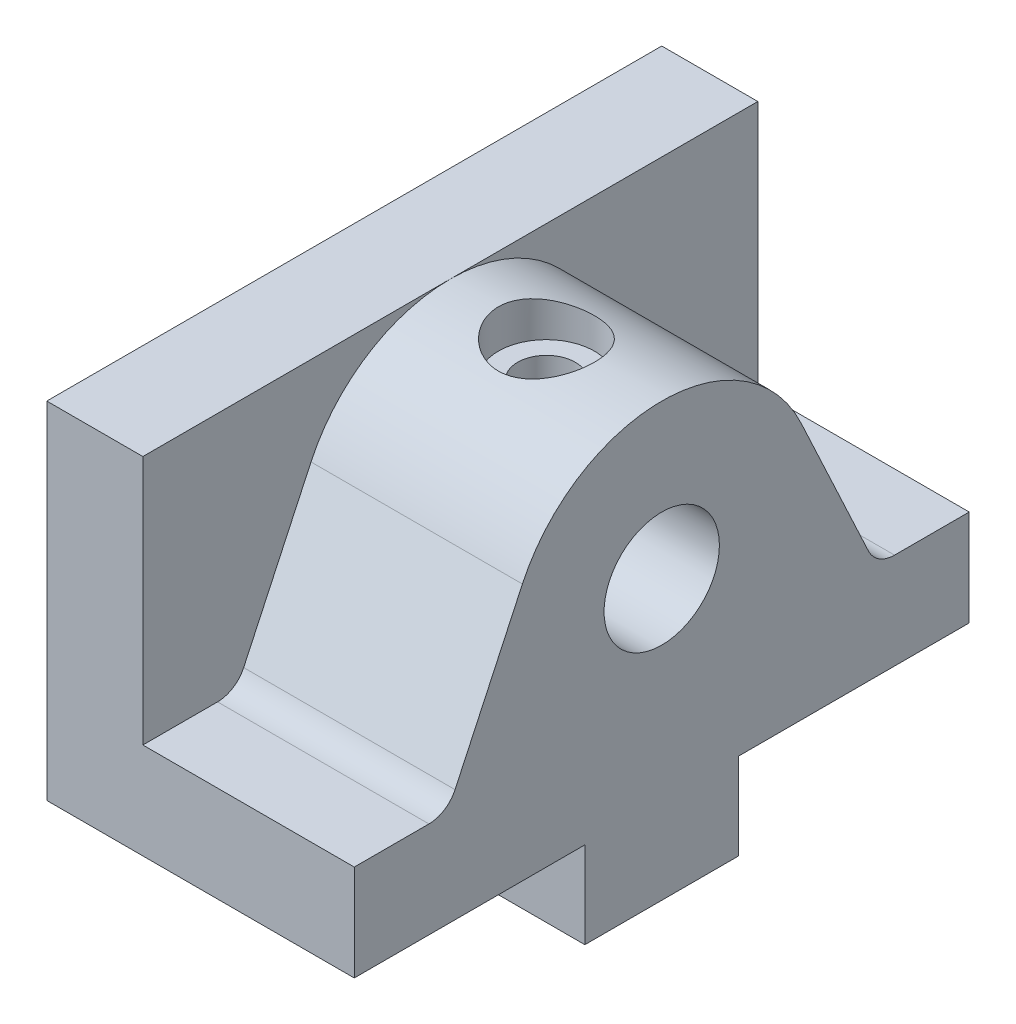
ISO-10303-21;
HEADER;
FILE_DESCRIPTION(('STEP AP214'),'2;1');
FILE_NAME('part.step','',(''),(''),'','','');
FILE_SCHEMA(('AUTOMOTIVE_DESIGN { 1 0 10303 214 1 1 1 1 }'));
ENDSEC;
DATA;
#1=APPLICATION_CONTEXT('core data for automotive mechanical design processes');
#2=APPLICATION_PROTOCOL_DEFINITION('international standard','automotive_design',2000,#1);
#3=PRODUCT_CONTEXT('',#1,'mechanical');
#4=PRODUCT('Part','Part','',(#3));
#5=PRODUCT_RELATED_PRODUCT_CATEGORY('part','',(#4));
#6=PRODUCT_DEFINITION_FORMATION('','',#4);
#7=PRODUCT_DEFINITION_CONTEXT('part definition',#1,'design');
#8=PRODUCT_DEFINITION('design','',#6,#7);
#9=PRODUCT_DEFINITION_SHAPE('','',#8);
#10=(LENGTH_UNIT() NAMED_UNIT(*) SI_UNIT(.MILLI.,.METRE.));
#11=(NAMED_UNIT(*) PLANE_ANGLE_UNIT() SI_UNIT($,.RADIAN.));
#12=(NAMED_UNIT(*) SI_UNIT($,.STERADIAN.) SOLID_ANGLE_UNIT());
#13=UNCERTAINTY_MEASURE_WITH_UNIT(LENGTH_MEASURE(1.E-05),#10,'distance_accuracy_value','');
#14=(GEOMETRIC_REPRESENTATION_CONTEXT(3) GLOBAL_UNCERTAINTY_ASSIGNED_CONTEXT((#13)) GLOBAL_UNIT_ASSIGNED_CONTEXT((#10,
#11,#12)) REPRESENTATION_CONTEXT('',''));
#15=CARTESIAN_POINT('',(0.,0.,0.));
#16=DIRECTION('',(0.,0.,1.));
#17=DIRECTION('',(1.,0.,0.));
#18=AXIS2_PLACEMENT_3D('',#15,#16,#17);
#19=CARTESIAN_POINT('',(0.,0.,32.));
#20=DIRECTION('',(0.,1.,0.));
#21=DIRECTION('',(0.,0.,1.));
#22=AXIS2_PLACEMENT_3D('',#19,#20,#21);
#23=PLANE('',#22);
#24=DIRECTION('',(1.,0.,0.));
#25=VECTOR('',#24,1.);
#26=CARTESIAN_POINT('',(0.,0.,-8.));
#27=LINE('',#26,#25);
#28=CARTESIAN_POINT('',(0.,0.,-8.));
#29=VERTEX_POINT('',#28);
#30=CARTESIAN_POINT('',(32.,0.,-8.));
#31=VERTEX_POINT('',#30);
#32=EDGE_CURVE('E190',#29,#31,#27,.T.);
#33=ORIENTED_EDGE('',*,*,#32,.F.);
#34=DIRECTION('',(0.,0.,-1.));
#35=VECTOR('',#34,1.);
#36=CARTESIAN_POINT('',(0.,0.,32.));
#37=LINE('',#36,#35);
#38=CARTESIAN_POINT('',(0.,0.,-32.));
#39=VERTEX_POINT('',#38);
#40=EDGE_CURVE('E295',#29,#39,#37,.T.);
#41=ORIENTED_EDGE('',*,*,#40,.T.);
#42=DIRECTION('',(1.,0.,0.));
#43=VECTOR('',#42,1.);
#44=CARTESIAN_POINT('',(0.,0.,-32.));
#45=LINE('',#44,#43);
#46=CARTESIAN_POINT('',(32.,0.,-32.));
#47=VERTEX_POINT('',#46);
#48=EDGE_CURVE('E269',#39,#47,#45,.T.);
#49=ORIENTED_EDGE('',*,*,#48,.T.);
#50=DIRECTION('',(0.,0.,-1.));
#51=VECTOR('',#50,1.);
#52=CARTESIAN_POINT('',(32.,0.,32.));
#53=LINE('',#52,#51);
#54=EDGE_CURVE('E291',#31,#47,#53,.T.);
#55=ORIENTED_EDGE('',*,*,#54,.F.);
#56=EDGE_LOOP('',(#33,#41,#49,#55));
#57=FACE_BOUND('',#56,.T.);
#58=ADVANCED_FACE('F33',(#57),#23,.F.);
#59=CARTESIAN_POINT('',(32.,10.,32.));
#60=DIRECTION('',(0.,-1.,0.));
#61=DIRECTION('',(1.,0.,0.));
#62=AXIS2_PLACEMENT_3D('',#59,#60,#61);
#63=PLANE('',#62);
#64=DIRECTION('',(1.,0.,0.));
#65=VECTOR('',#64,1.);
#66=CARTESIAN_POINT('',(-500000.,10.,24.2283340673724));
#67=LINE('',#66,#65);
#68=CARTESIAN_POINT('',(9.99999999987722,10.,24.2283340673724));
#69=VERTEX_POINT('',#68);
#70=CARTESIAN_POINT('',(32.,10.,24.2283340673724));
#71=VERTEX_POINT('',#70);
#72=EDGE_CURVE('E234',#69,#71,#67,.T.);
#73=ORIENTED_EDGE('',*,*,#72,.F.);
#74=DIRECTION('',(0.,0.,-1.));
#75=VECTOR('',#74,1.);
#76=CARTESIAN_POINT('',(10.,10.,32.));
#77=LINE('',#76,#75);
#78=CARTESIAN_POINT('',(10.,10.,32.));
#79=VERTEX_POINT('',#78);
#80=EDGE_CURVE('E284',#79,#69,#77,.T.);
#81=ORIENTED_EDGE('',*,*,#80,.F.);
#82=DIRECTION('',(-1.,0.,0.));
#83=VECTOR('',#82,1.);
#84=CARTESIAN_POINT('',(32.,10.,32.));
#85=LINE('',#84,#83);
#86=CARTESIAN_POINT('',(32.,10.,32.));
#87=VERTEX_POINT('',#86);
#88=EDGE_CURVE('E259',#87,#79,#85,.T.);
#89=ORIENTED_EDGE('',*,*,#88,.F.);
#90=DIRECTION('',(0.,0.,-1.));
#91=VECTOR('',#90,1.);
#92=CARTESIAN_POINT('',(32.,10.,32.));
#93=LINE('',#92,#91);
#94=EDGE_CURVE('E288',#87,#71,#93,.T.);
#95=ORIENTED_EDGE('',*,*,#94,.T.);
#96=EDGE_LOOP('',(#73,#81,#89,#95));
#97=FACE_BOUND('',#96,.T.);
#98=ADVANCED_FACE('F324',(#97),#63,.F.);
#99=CARTESIAN_POINT('',(10.,10.,32.));
#100=DIRECTION('',(-1.,0.,0.));
#101=DIRECTION('',(0.,-1.,0.));
#102=AXIS2_PLACEMENT_3D('',#99,#100,#101);
#103=PLANE('',#102);
#104=CARTESIAN_POINT('',(9.99999999999091,13.,-24.2283340673724));
#105=DIRECTION('',(-1.,0.,0.));
#106=DIRECTION('',(0.,-1.,0.));
#107=AXIS2_PLACEMENT_3D('',#104,#105,#106);
#108=CIRCLE('',#107,3.);
#109=CARTESIAN_POINT('',(9.99999999987722,11.7321452147779,-21.5094107062624));
#110=VERTEX_POINT('',#109);
#111=CARTESIAN_POINT('',(9.99999999987722,10.,-24.2283340673724));
#112=VERTEX_POINT('',#111);
#113=EDGE_CURVE('E244',#110,#112,#108,.F.);
#114=ORIENTED_EDGE('',*,*,#113,.T.);
#115=CARTESIAN_POINT('',(10.,10.,-32.));
#116=VERTEX_POINT('',#115);
#117=EDGE_CURVE('E283',#112,#116,#77,.T.);
#118=ORIENTED_EDGE('',*,*,#117,.T.);
#119=DIRECTION('',(0.,1.,0.));
#120=VECTOR('',#119,1.);
#121=CARTESIAN_POINT('',(10.,10.,-32.));
#122=LINE('',#121,#120);
#123=CARTESIAN_POINT('',(10.,36.,-32.));
#124=VERTEX_POINT('',#123);
#125=EDGE_CURVE('E253',#116,#124,#122,.T.);
#126=ORIENTED_EDGE('',*,*,#125,.T.);
#127=DIRECTION('',(0.,0.,-1.));
#128=VECTOR('',#127,1.);
#129=CARTESIAN_POINT('',(10.,36.,32.));
#130=LINE('',#129,#128);
#131=CARTESIAN_POINT('',(9.9999999999909,36.,0.));
#132=VERTEX_POINT('',#131);
#133=EDGE_CURVE('E263',#132,#124,#130,.T.);
#134=ORIENTED_EDGE('',*,*,#133,.F.);
#135=CARTESIAN_POINT('',(9.99999999999091,20.,0.));
#136=DIRECTION('',(-1.,0.,0.));
#137=DIRECTION('',(0.,-1.,0.));
#138=AXIS2_PLACEMENT_3D('',#135,#136,#137);
#139=CIRCLE('',#138,16.);
#140=CARTESIAN_POINT('',(9.99999999999091,26.7618921878512,-14.5009245925864));
#141=VERTEX_POINT('',#140);
#142=EDGE_CURVE('E213',#141,#132,#139,.F.);
#143=ORIENTED_EDGE('',*,*,#142,.F.);
#144=DIRECTION('',(0.,-0.906307787036649,-0.4226182617407));
#145=VECTOR('',#144,1.);
#146=CARTESIAN_POINT('',(9.99999999999091,26.7618921878786,-14.5009245925736));
#147=LINE('',#146,#145);
#148=EDGE_CURVE('E207',#141,#110,#147,.T.);
#149=ORIENTED_EDGE('',*,*,#148,.T.);
#150=EDGE_LOOP('',(#114,#118,#126,#134,#143,#149));
#151=FACE_BOUND('',#150,.T.);
#152=ADVANCED_FACE('F312',(#151),#103,.F.);
#153=CARTESIAN_POINT('',(9.99999999999091,13.,24.2283340673723));
#154=DIRECTION('',(-1.,0.,0.));
#155=DIRECTION('',(0.,-1.,0.));
#156=AXIS2_PLACEMENT_3D('',#153,#154,#155);
#157=CIRCLE('',#156,3.);
#158=CARTESIAN_POINT('',(9.99999999987722,11.7321452147779,21.5094107062624));
#159=VERTEX_POINT('',#158);
#160=EDGE_CURVE('E215',#69,#159,#157,.F.);
#161=ORIENTED_EDGE('',*,*,#160,.T.);
#162=DIRECTION('',(0.,-0.90630778703665,0.4226182617407));
#163=VECTOR('',#162,1.);
#164=CARTESIAN_POINT('',(9.99999999999091,26.7618921878786,14.5009245925736));
#165=LINE('',#164,#163);
#166=CARTESIAN_POINT('',(9.99999999987722,26.7618921878512,14.5009245925864));
#167=VERTEX_POINT('',#166);
#168=EDGE_CURVE('E210',#167,#159,#165,.T.);
#169=ORIENTED_EDGE('',*,*,#168,.F.);
#170=CARTESIAN_POINT('',(9.99999999999091,20.,0.));
#171=DIRECTION('',(-1.,0.,0.));
#172=DIRECTION('',(0.,-1.,0.));
#173=AXIS2_PLACEMENT_3D('',#170,#171,#172);
#174=CIRCLE('',#173,16.);
#175=EDGE_CURVE('E45',#167,#132,#174,.T.);
#176=ORIENTED_EDGE('',*,*,#175,.T.);
#177=CARTESIAN_POINT('',(10.,36.,32.));
#178=VERTEX_POINT('',#177);
#179=EDGE_CURVE('E280',#178,#132,#130,.T.);
#180=ORIENTED_EDGE('',*,*,#179,.F.);
#181=DIRECTION('',(0.,1.,0.));
#182=VECTOR('',#181,1.);
#183=CARTESIAN_POINT('',(10.,10.,32.));
#184=LINE('',#183,#182);
#185=EDGE_CURVE('E261',#79,#178,#184,.T.);
#186=ORIENTED_EDGE('',*,*,#185,.F.);
#187=ORIENTED_EDGE('',*,*,#80,.T.);
#188=EDGE_LOOP('',(#161,#169,#176,#180,#186,#187));
#189=FACE_BOUND('',#188,.T.);
#190=ADVANCED_FACE('F306',(#189),#103,.F.);
#191=CARTESIAN_POINT('',(10.,36.,32.));
#192=DIRECTION('',(0.,-1.,0.));
#193=DIRECTION('',(0.,0.,-1.));
#194=AXIS2_PLACEMENT_3D('',#191,#192,#193);
#195=PLANE('',#194);
#196=DIRECTION('',(-1.,0.,0.));
#197=VECTOR('',#196,1.);
#198=CARTESIAN_POINT('',(10.,36.,-32.));
#199=LINE('',#198,#197);
#200=CARTESIAN_POINT('',(0.,36.,-32.));
#201=VERTEX_POINT('',#200);
#202=EDGE_CURVE('E219',#124,#201,#199,.T.);
#203=ORIENTED_EDGE('',*,*,#202,.T.);
#204=DIRECTION('',(0.,0.,-1.));
#205=VECTOR('',#204,1.);
#206=CARTESIAN_POINT('',(0.,36.,32.));
#207=LINE('',#206,#205);
#208=CARTESIAN_POINT('',(0.,36.,32.));
#209=VERTEX_POINT('',#208);
#210=EDGE_CURVE('E299',#209,#201,#207,.T.);
#211=ORIENTED_EDGE('',*,*,#210,.F.);
#212=DIRECTION('',(-1.,0.,0.));
#213=VECTOR('',#212,1.);
#214=CARTESIAN_POINT('',(10.,36.,32.));
#215=LINE('',#214,#213);
#216=EDGE_CURVE('E249',#178,#209,#215,.T.);
#217=ORIENTED_EDGE('',*,*,#216,.F.);
#218=ORIENTED_EDGE('',*,*,#179,.T.);
#219=ORIENTED_EDGE('',*,*,#133,.T.);
#220=EDGE_LOOP('',(#203,#211,#217,#218,#219));
#221=FACE_BOUND('',#220,.T.);
#222=ADVANCED_FACE('F35',(#221),#195,.F.);
#223=CARTESIAN_POINT('',(0.,36.,32.));
#224=DIRECTION('',(1.,0.,0.));
#225=DIRECTION('',(0.,0.,-1.));
#226=AXIS2_PLACEMENT_3D('',#223,#224,#225);
#227=PLANE('',#226);
#228=DIRECTION('',(0.,-1.,0.));
#229=VECTOR('',#228,1.);
#230=CARTESIAN_POINT('',(0.,36.,-32.));
#231=LINE('',#230,#229);
#232=EDGE_CURVE('E266',#201,#39,#231,.T.);
#233=ORIENTED_EDGE('',*,*,#232,.T.);
#234=ORIENTED_EDGE('',*,*,#40,.F.);
#235=DIRECTION('',(0.,1.,0.));
#236=VECTOR('',#235,1.);
#237=CARTESIAN_POINT('',(0.,0.,-8.));
#238=LINE('',#237,#236);
#239=CARTESIAN_POINT('',(0.,-9.,-8.));
#240=VERTEX_POINT('',#239);
#241=EDGE_CURVE('E181',#240,#29,#238,.T.);
#242=ORIENTED_EDGE('',*,*,#241,.F.);
#243=DIRECTION('',(0.,0.,-1.));
#244=VECTOR('',#243,1.);
#245=CARTESIAN_POINT('',(0.,-9.,8.));
#246=LINE('',#245,#244);
#247=CARTESIAN_POINT('',(0.,-9.,8.));
#248=VERTEX_POINT('',#247);
#249=EDGE_CURVE('E187',#248,#240,#246,.T.);
#250=ORIENTED_EDGE('',*,*,#249,.F.);
#251=DIRECTION('',(0.,-1.,0.));
#252=VECTOR('',#251,1.);
#253=CARTESIAN_POINT('',(0.,-9.,8.));
#254=LINE('',#253,#252);
#255=CARTESIAN_POINT('',(0.,0.,8.));
#256=VERTEX_POINT('',#255);
#257=EDGE_CURVE('E183',#256,#248,#254,.T.);
#258=ORIENTED_EDGE('',*,*,#257,.F.);
#259=CARTESIAN_POINT('',(0.,0.,32.));
#260=VERTEX_POINT('',#259);
#261=EDGE_CURVE('E296',#260,#256,#37,.T.);
#262=ORIENTED_EDGE('',*,*,#261,.F.);
#263=DIRECTION('',(0.,-1.,0.));
#264=VECTOR('',#263,1.);
#265=CARTESIAN_POINT('',(0.,36.,32.));
#266=LINE('',#265,#264);
#267=EDGE_CURVE('E252',#209,#260,#266,.T.);
#268=ORIENTED_EDGE('',*,*,#267,.F.);
#269=ORIENTED_EDGE('',*,*,#210,.T.);
#270=EDGE_LOOP('',(#233,#234,#242,#250,#258,#262,#268,#269));
#271=FACE_BOUND('',#270,.T.);
#272=ADVANCED_FACE('F369',(#271),#227,.F.);
#273=ORIENTED_EDGE('',*,*,#261,.T.);
#274=DIRECTION('',(1.,0.,0.));
#275=VECTOR('',#274,1.);
#276=CARTESIAN_POINT('',(0.,0.,8.));
#277=LINE('',#276,#275);
#278=CARTESIAN_POINT('',(32.,0.,8.));
#279=VERTEX_POINT('',#278);
#280=EDGE_CURVE('E201',#256,#279,#277,.T.);
#281=ORIENTED_EDGE('',*,*,#280,.T.);
#282=CARTESIAN_POINT('',(32.,0.,32.));
#283=VERTEX_POINT('',#282);
#284=EDGE_CURVE('E292',#283,#279,#53,.T.);
#285=ORIENTED_EDGE('',*,*,#284,.F.);
#286=DIRECTION('',(1.,0.,0.));
#287=VECTOR('',#286,1.);
#288=CARTESIAN_POINT('',(0.,0.,32.));
#289=LINE('',#288,#287);
#290=EDGE_CURVE('E255',#260,#283,#289,.T.);
#291=ORIENTED_EDGE('',*,*,#290,.F.);
#292=EDGE_LOOP('',(#273,#281,#285,#291));
#293=FACE_BOUND('',#292,.T.);
#294=ADVANCED_FACE('F360',(#293),#23,.F.);
#295=CARTESIAN_POINT('',(32.,0.,32.));
#296=DIRECTION('',(-1.,0.,0.));
#297=DIRECTION('',(0.,0.,1.));
#298=AXIS2_PLACEMENT_3D('',#295,#296,#297);
#299=PLANE('',#298);
#300=CARTESIAN_POINT('',(32.,20.,0.));
#301=DIRECTION('',(1.,0.,0.));
#302=DIRECTION('',(0.,0.,-1.));
#303=AXIS2_PLACEMENT_3D('',#300,#301,#302);
#304=CIRCLE('',#303,6.);
#305=CARTESIAN_POINT('',(32.,20.,-6.));
#306=VERTEX_POINT('',#305);
#307=EDGE_CURVE('E198',#306,#306,#304,.T.);
#308=ORIENTED_EDGE('',*,*,#307,.F.);
#309=EDGE_LOOP('',(#308));
#310=FACE_BOUND('',#309,.T.);
#311=DIRECTION('',(0.,1.,0.));
#312=VECTOR('',#311,1.);
#313=CARTESIAN_POINT('',(32.,0.,-32.));
#314=LINE('',#313,#312);
#315=CARTESIAN_POINT('',(32.,10.,-32.));
#316=VERTEX_POINT('',#315);
#317=EDGE_CURVE('E272',#47,#316,#314,.T.);
#318=ORIENTED_EDGE('',*,*,#317,.T.);
#319=CARTESIAN_POINT('',(32.,10.,-24.2283340673724));
#320=VERTEX_POINT('',#319);
#321=EDGE_CURVE('E287',#320,#316,#93,.T.);
#322=ORIENTED_EDGE('',*,*,#321,.F.);
#323=CARTESIAN_POINT('',(32.,13.,-24.2283340673724));
#324=DIRECTION('',(1.,0.,0.));
#325=DIRECTION('',(0.,0.,-1.));
#326=AXIS2_PLACEMENT_3D('',#323,#324,#325);
#327=CIRCLE('',#326,3.);
#328=CARTESIAN_POINT('',(32.,11.7321452147779,-21.5094107062624));
#329=VERTEX_POINT('',#328);
#330=EDGE_CURVE('E224',#329,#320,#327,.T.);
#331=ORIENTED_EDGE('',*,*,#330,.F.);
#332=DIRECTION('',(0.,-0.906307787036649,-0.4226182617407));
#333=VECTOR('',#332,1.);
#334=CARTESIAN_POINT('',(32.,26.7618921878512,-14.5009245925864));
#335=LINE('',#334,#333);
#336=CARTESIAN_POINT('',(32.,26.7618921878512,-14.5009245925864));
#337=VERTEX_POINT('',#336);
#338=EDGE_CURVE('E221',#337,#329,#335,.T.);
#339=ORIENTED_EDGE('',*,*,#338,.F.);
#340=CARTESIAN_POINT('',(32.,20.,0.));
#341=DIRECTION('',(1.,0.,0.));
#342=DIRECTION('',(0.,0.,-1.));
#343=AXIS2_PLACEMENT_3D('',#340,#341,#342);
#344=CIRCLE('',#343,16.);
#345=CARTESIAN_POINT('',(32.,26.7618921878512,14.5009245925864));
#346=VERTEX_POINT('',#345);
#347=EDGE_CURVE('E216',#337,#346,#344,.T.);
#348=ORIENTED_EDGE('',*,*,#347,.T.);
#349=DIRECTION('',(0.,-0.906307787036649,0.4226182617407));
#350=VECTOR('',#349,1.);
#351=CARTESIAN_POINT('',(32.,26.7618921878512,14.5009245925864));
#352=LINE('',#351,#350);
#353=CARTESIAN_POINT('',(32.,11.7321452147779,21.5094107062624));
#354=VERTEX_POINT('',#353);
#355=EDGE_CURVE('E220',#346,#354,#352,.T.);
#356=ORIENTED_EDGE('',*,*,#355,.T.);
#357=CARTESIAN_POINT('',(32.,13.,24.2283340673723));
#358=DIRECTION('',(1.,0.,0.));
#359=DIRECTION('',(0.,0.,-1.));
#360=AXIS2_PLACEMENT_3D('',#357,#358,#359);
#361=CIRCLE('',#360,3.);
#362=EDGE_CURVE('E226',#71,#354,#361,.T.);
#363=ORIENTED_EDGE('',*,*,#362,.F.);
#364=ORIENTED_EDGE('',*,*,#94,.F.);
#365=DIRECTION('',(0.,1.,0.));
#366=VECTOR('',#365,1.);
#367=CARTESIAN_POINT('',(32.,0.,32.));
#368=LINE('',#367,#366);
#369=EDGE_CURVE('E257',#283,#87,#368,.T.);
#370=ORIENTED_EDGE('',*,*,#369,.F.);
#371=ORIENTED_EDGE('',*,*,#284,.T.);
#372=DIRECTION('',(0.,-1.,0.));
#373=VECTOR('',#372,1.);
#374=CARTESIAN_POINT('',(32.,-9.,8.));
#375=LINE('',#374,#373);
#376=CARTESIAN_POINT('',(32.,-9.,8.));
#377=VERTEX_POINT('',#376);
#378=EDGE_CURVE('E52',#279,#377,#375,.T.);
#379=ORIENTED_EDGE('',*,*,#378,.T.);
#380=DIRECTION('',(0.,0.,-1.));
#381=VECTOR('',#380,1.);
#382=CARTESIAN_POINT('',(32.,-9.,8.));
#383=LINE('',#382,#381);
#384=CARTESIAN_POINT('',(32.,-9.,-8.));
#385=VERTEX_POINT('',#384);
#386=EDGE_CURVE('E184',#377,#385,#383,.T.);
#387=ORIENTED_EDGE('',*,*,#386,.T.);
#388=DIRECTION('',(0.,1.,0.));
#389=VECTOR('',#388,1.);
#390=CARTESIAN_POINT('',(32.,0.,-8.));
#391=LINE('',#390,#389);
#392=EDGE_CURVE('E180',#385,#31,#391,.T.);
#393=ORIENTED_EDGE('',*,*,#392,.T.);
#394=ORIENTED_EDGE('',*,*,#54,.T.);
#395=EDGE_LOOP('',(#318,#322,#331,#339,#348,#356,#363,#364,#370,#371,#379,#387,#393,#394));
#396=FACE_BOUND('',#395,.T.);
#397=ADVANCED_FACE('F331',(#310,#396),#299,.F.);
#398=ORIENTED_EDGE('',*,*,#117,.F.);
#399=DIRECTION('',(1.,0.,0.));
#400=VECTOR('',#399,1.);
#401=CARTESIAN_POINT('',(-500000.,10.,-24.2283340673724));
#402=LINE('',#401,#400);
#403=EDGE_CURVE('E236',#112,#320,#402,.T.);
#404=ORIENTED_EDGE('',*,*,#403,.T.);
#405=ORIENTED_EDGE('',*,*,#321,.T.);
#406=DIRECTION('',(-1.,0.,0.));
#407=VECTOR('',#406,1.);
#408=CARTESIAN_POINT('',(32.,10.,-32.));
#409=LINE('',#408,#407);
#410=EDGE_CURVE('E275',#316,#116,#409,.T.);
#411=ORIENTED_EDGE('',*,*,#410,.T.);
#412=EDGE_LOOP('',(#398,#404,#405,#411));
#413=FACE_BOUND('',#412,.T.);
#414=ADVANCED_FACE('F365',(#413),#63,.F.);
#415=CARTESIAN_POINT('',(0.,0.,32.));
#416=DIRECTION('',(0.,0.,1.));
#417=DIRECTION('',(1.,0.,0.));
#418=AXIS2_PLACEMENT_3D('',#415,#416,#417);
#419=PLANE('',#418);
#420=ORIENTED_EDGE('',*,*,#216,.T.);
#421=ORIENTED_EDGE('',*,*,#267,.T.);
#422=ORIENTED_EDGE('',*,*,#290,.T.);
#423=ORIENTED_EDGE('',*,*,#369,.T.);
#424=ORIENTED_EDGE('',*,*,#88,.T.);
#425=ORIENTED_EDGE('',*,*,#185,.T.);
#426=EDGE_LOOP('',(#420,#421,#422,#423,#424,#425));
#427=FACE_BOUND('',#426,.T.);
#428=ADVANCED_FACE('F318',(#427),#419,.T.);
#429=CARTESIAN_POINT('',(0.,0.,-32.));
#430=DIRECTION('',(0.,0.,1.));
#431=DIRECTION('',(1.,0.,0.));
#432=AXIS2_PLACEMENT_3D('',#429,#430,#431);
#433=PLANE('',#432);
#434=ORIENTED_EDGE('',*,*,#202,.F.);
#435=ORIENTED_EDGE('',*,*,#125,.F.);
#436=ORIENTED_EDGE('',*,*,#410,.F.);
#437=ORIENTED_EDGE('',*,*,#317,.F.);
#438=ORIENTED_EDGE('',*,*,#48,.F.);
#439=ORIENTED_EDGE('',*,*,#232,.F.);
#440=EDGE_LOOP('',(#434,#435,#436,#437,#438,#439));
#441=FACE_BOUND('',#440,.T.);
#442=ADVANCED_FACE('F341',(#441),#433,.F.);
#443=CARTESIAN_POINT('',(-500000.,26.7618921878512,-14.5009245925864));
#444=DIRECTION('',(0.,-0.4226182617407,0.906307787036649));
#445=DIRECTION('',(0.,-0.906307787036649,-0.4226182617407));
#446=AXIS2_PLACEMENT_3D('',#443,#444,#445);
#447=PLANE('',#446);
#448=ORIENTED_EDGE('',*,*,#148,.F.);
#449=DIRECTION('',(1.,0.,0.));
#450=VECTOR('',#449,1.);
#451=CARTESIAN_POINT('',(-500000.,26.7618921878512,-14.5009245925864));
#452=LINE('',#451,#450);
#453=EDGE_CURVE('E60',#141,#337,#452,.T.);
#454=ORIENTED_EDGE('',*,*,#453,.T.);
#455=ORIENTED_EDGE('',*,*,#338,.T.);
#456=DIRECTION('',(1.,0.,0.));
#457=VECTOR('',#456,1.);
#458=CARTESIAN_POINT('',(-500000.,11.7321452147779,-21.5094107062624));
#459=LINE('',#458,#457);
#460=EDGE_CURVE('E239',#110,#329,#459,.T.);
#461=ORIENTED_EDGE('',*,*,#460,.F.);
#462=EDGE_LOOP('',(#448,#454,#455,#461));
#463=FACE_BOUND('',#462,.T.);
#464=ADVANCED_FACE('F349',(#463),#447,.F.);
#465=CARTESIAN_POINT('',(-500000.,13.,-24.2283340673724));
#466=DIRECTION('',(1.,0.,0.));
#467=DIRECTION('',(0.,0.,-1.));
#468=AXIS2_PLACEMENT_3D('',#465,#466,#467);
#469=CYLINDRICAL_SURFACE('',#468,3.);
#470=ORIENTED_EDGE('',*,*,#113,.F.);
#471=ORIENTED_EDGE('',*,*,#460,.T.);
#472=ORIENTED_EDGE('',*,*,#330,.T.);
#473=ORIENTED_EDGE('',*,*,#403,.F.);
#474=EDGE_LOOP('',(#470,#471,#472,#473));
#475=FACE_BOUND('',#474,.T.);
#476=ADVANCED_FACE('F399',(#475),#469,.F.);
#477=CARTESIAN_POINT('',(-500000.,13.,24.2283340673723));
#478=DIRECTION('',(1.,0.,0.));
#479=DIRECTION('',(0.,0.,-1.));
#480=AXIS2_PLACEMENT_3D('',#477,#478,#479);
#481=CYLINDRICAL_SURFACE('',#480,3.);
#482=ORIENTED_EDGE('',*,*,#160,.F.);
#483=ORIENTED_EDGE('',*,*,#72,.T.);
#484=ORIENTED_EDGE('',*,*,#362,.T.);
#485=DIRECTION('',(1.,0.,0.));
#486=VECTOR('',#485,1.);
#487=CARTESIAN_POINT('',(-500000.,11.7321452147779,21.5094107062624));
#488=LINE('',#487,#486);
#489=EDGE_CURVE('E232',#159,#354,#488,.T.);
#490=ORIENTED_EDGE('',*,*,#489,.F.);
#491=EDGE_LOOP('',(#482,#483,#484,#490));
#492=FACE_BOUND('',#491,.T.);
#493=ADVANCED_FACE('F328',(#492),#481,.F.);
#494=CARTESIAN_POINT('',(-500000.,26.7618921878512,14.5009245925864));
#495=DIRECTION('',(0.,0.4226182617407,0.90630778703665));
#496=DIRECTION('',(0.,-0.90630778703665,0.4226182617407));
#497=AXIS2_PLACEMENT_3D('',#494,#495,#496);
#498=PLANE('',#497);
#499=DIRECTION('',(1.,0.,0.));
#500=VECTOR('',#499,1.);
#501=CARTESIAN_POINT('',(-500000.,26.7618921878512,14.5009245925864));
#502=LINE('',#501,#500);
#503=EDGE_CURVE('E212',#167,#346,#502,.T.);
#504=ORIENTED_EDGE('',*,*,#503,.F.);
#505=ORIENTED_EDGE('',*,*,#168,.T.);
#506=ORIENTED_EDGE('',*,*,#489,.T.);
#507=ORIENTED_EDGE('',*,*,#355,.F.);
#508=EDGE_LOOP('',(#504,#505,#506,#507));
#509=FACE_BOUND('',#508,.T.);
#510=ADVANCED_FACE('F336',(#509),#498,.T.);
#511=CARTESIAN_POINT('',(-500000.,20.,0.));
#512=DIRECTION('',(1.,0.,0.));
#513=DIRECTION('',(0.,0.,-1.));
#514=AXIS2_PLACEMENT_3D('',#511,#512,#513);
#515=CYLINDRICAL_SURFACE('',#514,16.);
#516=CARTESIAN_POINT('',(20.,35.1986841535707,4.99999999999999));
#517=CARTESIAN_POINT('',(20.2733881444511,35.1986858388479,4.99999815120852));
#518=CARTESIAN_POINT('',(20.5467950748157,35.2061412603009,4.97750155166163));
#519=CARTESIAN_POINT('',(21.0855766435056,35.2350255598557,4.88836701605166));
#520=CARTESIAN_POINT('',(21.3509490909254,35.2564582140987,4.82171715130071));
#521=CARTESIAN_POINT('',(21.865779607726,35.3106375534646,4.646791528944));
#522=CARTESIAN_POINT('',(22.1152649324196,35.3433642077793,4.53858942946874));
#523=CARTESIAN_POINT('',(22.5926107834518,35.4164162487397,4.28387656692855));
#524=CARTESIAN_POINT('',(22.8204674798361,35.4567429774309,4.13735903622813));
#525=CARTESIAN_POINT('',(23.2559154699691,35.5420051067458,3.80478428249333));
#526=CARTESIAN_POINT('',(23.4626544377388,35.5870449353906,3.61763759888651));
#527=CARTESIAN_POINT('',(23.8423840528312,35.6757698344115,3.21144818582855));
#528=CARTESIAN_POINT('',(24.0153699877737,35.7194547149035,2.99240101008173));
#529=CARTESIAN_POINT('',(24.3264442520397,35.8017421356018,2.52250364998253));
#530=CARTESIAN_POINT('',(24.4636548153208,35.8402073825098,2.27104622609014));
#531=CARTESIAN_POINT('',(24.693504199418,35.9065020733195,1.74721693142469));
#532=CARTESIAN_POINT('',(24.7861534965947,35.9343340167957,1.47484999395991));
#533=CARTESIAN_POINT('',(24.921404512386,35.9754870328338,0.925857427876588));
#534=CARTESIAN_POINT('',(24.9654629991498,35.9892295593652,0.649622861884884));
#535=CARTESIAN_POINT('',(25.0068973857499,36.0021438350406,0.0933632559496174));
#536=CARTESIAN_POINT('',(25.0042838974357,36.001318896403,-0.186660907881112));
#537=CARTESIAN_POINT('',(24.9534068336578,35.9854846453017,-0.732297921408681));
#538=CARTESIAN_POINT('',(24.90672246595,35.9709660388861,-0.998074537246561));
#539=CARTESIAN_POINT('',(24.7716200398306,35.9299793024358,-1.51781225338293));
#540=CARTESIAN_POINT('',(24.6831992596564,35.9035103930892,-1.77177258191746));
#541=CARTESIAN_POINT('',(24.466119243704,35.8409383891792,-2.26431241261267));
#542=CARTESIAN_POINT('',(24.3369807657523,35.8047213446677,-2.50266562248492));
#543=CARTESIAN_POINT('',(24.0425156011842,35.7264689181548,-2.95481004460392));
#544=CARTESIAN_POINT('',(23.8771797634481,35.6844320658271,-3.16859502483331));
#545=CARTESIAN_POINT('',(23.506905460803,35.5969468293421,-3.57495079380936));
#546=CARTESIAN_POINT('',(23.3006037246558,35.5514292793946,-3.76626619636399));
#547=CARTESIAN_POINT('',(22.8584195926905,35.463624617787,-4.11195897038724));
#548=CARTESIAN_POINT('',(22.6225337176437,35.4213378870288,-4.26633199104441));
#549=CARTESIAN_POINT('',(22.1243301246158,35.3444338653166,-4.53521860076047));
#550=CARTESIAN_POINT('',(21.861746364043,35.3099076117647,-4.64926722798775));
#551=CARTESIAN_POINT('',(21.3197620326404,35.2535018111547,-4.8311338378195));
#552=CARTESIAN_POINT('',(21.0403675432316,35.2316177207011,-4.89896843059808));
#553=CARTESIAN_POINT('',(20.4847201897019,35.203982536282,-4.98405940745515));
#554=CARTESIAN_POINT('',(20.2087920150705,35.1976186557504,-5.0032381741554));
#555=CARTESIAN_POINT('',(19.6576410340315,35.2000430983967,-4.99586977992563));
#556=CARTESIAN_POINT('',(19.3824181252138,35.2088290802922,-4.96932968445779));
#557=CARTESIAN_POINT('',(18.848766813403,35.2399582993557,-4.87299494053064));
#558=CARTESIAN_POINT('',(18.5900829037156,35.2619021640793,-4.80447324642567));
#559=CARTESIAN_POINT('',(18.0879128320285,35.3164514932538,-4.6276149464455));
#560=CARTESIAN_POINT('',(17.844429156327,35.3490586964908,-4.51927184685156));
#561=CARTESIAN_POINT('',(17.3718435609232,35.4224215861276,-4.26230042624158));
#562=CARTESIAN_POINT('',(17.1433543376385,35.4633841395884,-4.11260589954904));
#563=CARTESIAN_POINT('',(16.7140386145605,35.5484139589106,-3.77842563472626));
#564=CARTESIAN_POINT('',(16.513219324306,35.5924820294262,-3.59393085877026));
#565=CARTESIAN_POINT('',(16.1363585363545,35.680967502506,-3.18629179102149));
#566=CARTESIAN_POINT('',(15.9616888554456,35.7253236914259,-2.96186259916099));
#567=CARTESIAN_POINT('',(15.6524358267186,35.8075623937461,-2.485806182612));
#568=CARTESIAN_POINT('',(15.5178506427588,35.845445203637,-2.23418020444057));
#569=CARTESIAN_POINT('',(15.2938777501153,35.9102524771399,-1.71242209333302));
#570=CARTESIAN_POINT('',(15.204162848627,35.9372559824475,-1.4424407371407));
#571=CARTESIAN_POINT('',(15.0717098456422,35.9776097059428,-0.890229016231134));
#572=CARTESIAN_POINT('',(15.0289570436667,35.990964196571,-0.608002513366912));
#573=CARTESIAN_POINT('',(14.9928359930016,36.0022321361783,-0.0519397466014212));
#574=CARTESIAN_POINT('',(14.9974861993167,36.0007651762952,0.221756767779827));
#575=CARTESIAN_POINT('',(15.0512472441938,35.9840391232427,0.764292887686064));
#576=CARTESIAN_POINT('',(15.1003551839665,35.9687809293069,1.03313280871111));
#577=CARTESIAN_POINT('',(15.2403760368863,35.9263828337909,1.55502047391504));
#578=CARTESIAN_POINT('',(15.3307584313776,35.899393918403,1.80822367378908));
#579=CARTESIAN_POINT('',(15.55028330883,35.8363178235255,2.29599370199196));
#580=CARTESIAN_POINT('',(15.6794324398909,35.8002290836789,2.53055732509068));
#581=CARTESIAN_POINT('',(15.9778910333684,35.7211958753129,2.98304677986773));
#582=CARTESIAN_POINT('',(16.1484140898387,35.6780603899497,3.20013842819623));
#583=CARTESIAN_POINT('',(16.5226395577751,35.5903494619749,3.60328316559622));
#584=CARTESIAN_POINT('',(16.7263518965851,35.5457735917335,3.78932693403593));
#585=CARTESIAN_POINT('',(17.1692628793198,35.458475702749,4.13131463641768));
#586=CARTESIAN_POINT('',(17.4094136123193,35.4158640332135,4.28605711968009));
#587=CARTESIAN_POINT('',(17.9135924809401,35.3392050100631,4.55281882983713));
#588=CARTESIAN_POINT('',(18.1776109057774,35.3051541945195,4.66485533611833));
#589=CARTESIAN_POINT('',(18.6988904692666,35.2522624175559,4.83484721744872));
#590=CARTESIAN_POINT('',(18.9548101897492,35.2323726005928,4.89659759350127));
#591=CARTESIAN_POINT('',(19.4738153283123,35.2055842579894,4.97916983261866));
#592=CARTESIAN_POINT('',(19.7368989647805,35.1986825317074,5.00000177922473));
#593=CARTESIAN_POINT('',(20.,35.1986841535707,4.99999999999999));
#594=B_SPLINE_CURVE_WITH_KNOTS('',3,(#516,#517,#518,#519,#520,#521,#522,#523,#524,#525,#526,
#527,#528,#529,#530,#531,#532,#533,#534,#535,#536,#537,#538,#539,#540,#541,#542,#543,#544,#545,
#546,#547,#548,#549,#550,#551,#552,#553,#554,#555,#556,#557,#558,#559,#560,#561,#562,#563,#564,
#565,#566,#567,#568,#569,#570,#571,#572,#573,#574,#575,#576,#577,#578,#579,#580,#581,#582,#583,
#584,#585,#586,#587,#588,#589,#590,#591,#592,#593),.UNSPECIFIED.,.T.,.F.,(4,2,2,2,2,2,2,2,2,2,2,
2,2,2,2,2,2,2,2,2,2,2,2,2,2,2,2,2,2,2,2,2,2,2,2,2,2,2,4),(0.,0.8191925501926,1.63860650823621,
2.4565745764701,3.27468721969408,4.11828322202559,4.96199691763474,5.8247928785379,
6.68738589670421,7.52334891340956,8.35912185886008,9.16603931878084,9.97300940759627,
10.78985618433,11.6069097085222,12.4580135574876,13.3092175941449,14.1699388374148,
15.0303505581974,15.8561973316032,16.6819164888478,17.4837588818589,18.2857320902129,
19.1107045324704,19.9358915205627,20.7952775125497,21.6546241327745,22.5076095717314,
23.3603279257153,24.1775520976717,24.9947229877817,25.8016738606782,26.6087631965522,
27.443227724294,28.2779423109722,29.1403118201674,30.0023320322718,30.7908941750078,
31.5792619677388),.UNSPECIFIED.);
#595=CARTESIAN_POINT('',(20.,35.1986841535707,4.99999999999999));
#596=VERTEX_POINT('',#595);
#597=EDGE_CURVE('E11',#596,#596,#594,.T.);
#598=ORIENTED_EDGE('',*,*,#597,.F.);
#599=EDGE_LOOP('',(#598));
#600=FACE_BOUND('',#599,.T.);
#601=ORIENTED_EDGE('',*,*,#453,.F.);
#602=ORIENTED_EDGE('',*,*,#142,.T.);
#603=ORIENTED_EDGE('',*,*,#175,.F.);
#604=ORIENTED_EDGE('',*,*,#503,.T.);
#605=ORIENTED_EDGE('',*,*,#347,.F.);
#606=EDGE_LOOP('',(#601,#602,#603,#604,#605));
#607=FACE_BOUND('',#606,.T.);
#608=ADVANCED_FACE('F337',(#600,#607),#515,.T.);
#609=CARTESIAN_POINT('',(8.,20.,0.));
#610=DIRECTION('',(1.,0.,0.));
#611=DIRECTION('',(0.,0.,-1.));
#612=AXIS2_PLACEMENT_3D('',#609,#610,#611);
#613=CYLINDRICAL_SURFACE('',#612,6.);
#614=CARTESIAN_POINT('',(20.,25.1961524227066,3.));
#615=CARTESIAN_POINT('',(20.0782002332591,25.1961533815141,2.99999910875737));
#616=CARTESIAN_POINT('',(20.1564099984646,25.1979258119113,2.99693611207794));
#617=CARTESIAN_POINT('',(20.3122080751421,25.2049393165712,2.98473565374508));
#618=CARTESIAN_POINT('',(20.3897960802685,25.2101820056608,2.97559536411628));
#619=CARTESIAN_POINT('',(20.6209440142464,25.2308820055821,2.9391691225804));
#620=CARTESIAN_POINT('',(20.7727509105333,25.2513107660721,2.902878058149));
#621=CARTESIAN_POINT('',(21.0663916335235,25.3024774692754,2.80829998089522));
#622=CARTESIAN_POINT('',(21.2082738017509,25.3331605157792,2.75012989346617));
#623=CARTESIAN_POINT('',(21.4802627617008,25.4012807296697,2.61380253964662));
#624=CARTESIAN_POINT('',(21.6103689158749,25.4387182624135,2.53564419197537));
#625=CARTESIAN_POINT('',(21.8669201461477,25.5199058355984,2.35399963256536));
#626=CARTESIAN_POINT('',(21.9921782021559,25.5639218457163,2.24895611137363));
#627=CARTESIAN_POINT('',(22.2242243696895,25.651159547025,2.01976141989962));
#628=CARTESIAN_POINT('',(22.3310032682567,25.6943808324562,1.89560077655245));
#629=CARTESIAN_POINT('',(22.5301016877323,25.7786442898889,1.62146869109162));
#630=CARTESIAN_POINT('',(22.6209613659272,25.8193431875225,1.47032156718994));
#631=CARTESIAN_POINT('',(22.7754224974281,25.8905226880054,1.15247107964639));
#632=CARTESIAN_POINT('',(22.8390411532466,25.9210097369081,0.985777614653088));
#633=CARTESIAN_POINT('',(22.9325139979892,25.9664138360306,0.654134831556282));
#634=CARTESIAN_POINT('',(22.9644485796481,25.9822844059557,0.489905370480165));
#635=CARTESIAN_POINT('',(23.000498355444,26.0002275160526,0.15771188707923));
#636=CARTESIAN_POINT('',(23.0046303821323,26.0023084049244,-0.0102498138110381));
#637=CARTESIAN_POINT('',(22.9857599673652,25.9928894562274,-0.329497576667921));
#638=CARTESIAN_POINT('',(22.9650859119219,25.9825548724797,-0.48096360970459));
#639=CARTESIAN_POINT('',(22.9013575098035,25.9512273620779,-0.777941303579841));
#640=CARTESIAN_POINT('',(22.8583014884221,25.9302336378681,-0.92345251797663));
#641=CARTESIAN_POINT('',(22.7507521442304,25.8791474825337,-1.20692822064062));
#642=CARTESIAN_POINT('',(22.6859704687994,25.8489331854518,-1.34476044303001));
#643=CARTESIAN_POINT('',(22.537210343292,25.7821294400464,-1.60793023199368));
#644=CARTESIAN_POINT('',(22.4532250204903,25.7455377104437,-1.73326330217191));
#645=CARTESIAN_POINT('',(22.2593115260605,25.665331584921,-1.98052168794677));
#646=CARTESIAN_POINT('',(22.1476814893583,25.6213803174282,-2.10100497271934));
#647=CARTESIAN_POINT('',(21.9062402580911,25.5336311808584,-2.32231036115798));
#648=CARTESIAN_POINT('',(21.7764152061043,25.4898334550261,-2.42311733790258));
#649=CARTESIAN_POINT('',(21.4920178566593,25.4043208466552,-2.6085269546345));
#650=CARTESIAN_POINT('',(21.336397564354,25.3629148575067,-2.691694028528));
#651=CARTESIAN_POINT('',(21.0924369453882,25.3091519440867,-2.79542837524198));
#652=CARTESIAN_POINT('',(21.0093436895952,25.2926194649543,-2.82650797342001));
#653=CARTESIAN_POINT('',(20.8401913969656,25.2629847346327,-2.88131297532033));
#654=CARTESIAN_POINT('',(20.7541342255252,25.2498803689785,-2.90504291399185));
#655=CARTESIAN_POINT('',(20.586628379776,25.2285545598839,-2.94323927983803));
#656=CARTESIAN_POINT('',(20.5053505743622,25.2200298226321,-2.95828810706486));
#657=CARTESIAN_POINT('',(20.3415647613341,25.2067273715729,-2.98163903200842));
#658=CARTESIAN_POINT('',(20.2590574162517,25.2019477092041,-2.98994463830254));
#659=CARTESIAN_POINT('',(20.0935289931973,25.1963366286361,-2.99968663811345));
#660=CARTESIAN_POINT('',(20.0105081180563,25.1955037402621,-3.00112558946313));
#661=CARTESIAN_POINT('',(19.8447135392353,25.1978095319997,-2.99712742537402));
#662=CARTESIAN_POINT('',(19.7619398192495,25.2009479440325,-2.99169077406596));
#663=CARTESIAN_POINT('',(19.5331408639573,25.2150449301025,-2.96710135231213));
#664=CARTESIAN_POINT('',(19.3880891897367,25.230191606605,-2.9405616310018));
#665=CARTESIAN_POINT('',(19.1048690892031,25.270816663845,-2.86709067362229));
#666=CARTESIAN_POINT('',(18.9667029081698,25.2962983902876,-2.82015283383763));
#667=CARTESIAN_POINT('',(18.6937738960801,25.3560878027303,-2.70494224478442));
#668=CARTESIAN_POINT('',(18.5594650720959,25.3907496041273,-2.63578205088436));
#669=CARTESIAN_POINT('',(18.303590061634,25.4646832779242,-2.47886133231338));
#670=CARTESIAN_POINT('',(18.1820304691885,25.5039575138799,-2.3910912526382));
#671=CARTESIAN_POINT('',(17.9390643733681,25.588640051403,-2.18651145695799));
#672=CARTESIAN_POINT('',(17.8196087291,25.6341975208474,-2.067435804994));
#673=CARTESIAN_POINT('',(17.6017631047052,25.7220270231092,-1.81021349814979));
#674=CARTESIAN_POINT('',(17.5033802403245,25.7642979430822,-1.67206042712514));
#675=CARTESIAN_POINT('',(17.3282788724264,25.8422408580664,-1.37560608443379));
#676=CARTESIAN_POINT('',(17.2522006581169,25.8777092522688,-1.21686929217555));
#677=CARTESIAN_POINT('',(17.1285862756894,25.9365006466729,-0.88656709446955));
#678=CARTESIAN_POINT('',(17.081025045158,25.9598343091953,-0.715013103124008));
#679=CARTESIAN_POINT('',(17.0198943081509,25.9900252464518,-0.380939047947197));
#680=CARTESIAN_POINT('',(17.0036063644392,25.998197839307,-0.219034335650391));
#681=CARTESIAN_POINT('',(16.9974702115665,26.0012639091934,0.105377961951198));
#682=CARTESIAN_POINT('',(17.0076127468168,25.9961620347605,0.267885316317459));
#683=CARTESIAN_POINT('',(17.0522491901335,25.9740190719064,0.577613962536138));
#684=CARTESIAN_POINT('',(17.0850944376657,25.9577868644244,0.725136901247721));
#685=CARTESIAN_POINT('',(17.1719811080321,25.9157627855145,1.01233790874441));
#686=CARTESIAN_POINT('',(17.2260255705425,25.8899695431946,1.15201484923628));
#687=CARTESIAN_POINT('',(17.3561807286887,25.829778017116,1.42627001605163));
#688=CARTESIAN_POINT('',(17.4331363415363,25.7950588762329,1.56037465678411));
#689=CARTESIAN_POINT('',(17.6058754214136,25.7206436338201,1.81432469711302));
#690=CARTESIAN_POINT('',(17.7016675359887,25.6809452494399,1.93416350676913));
#691=CARTESIAN_POINT('',(17.9203847224835,25.5958597881944,2.16873884087781));
#692=CARTESIAN_POINT('',(18.0450613207736,25.5502997550452,2.28178066887875));
#693=CARTESIAN_POINT('',(18.3123783280701,25.4618864950968,2.48600225783028));
#694=CARTESIAN_POINT('',(18.4550344610311,25.4190356875087,2.57716267726705));
#695=CARTESIAN_POINT('',(18.6825317933018,25.3600477490699,2.69665559342489));
#696=CARTESIAN_POINT('',(18.7619758009824,25.3410121914846,2.73405408762355));
#697=CARTESIAN_POINT('',(18.9243532830087,25.3057278306372,2.80191257626505));
#698=CARTESIAN_POINT('',(19.007284933748,25.2894775930144,2.83237614466583));
#699=CARTESIAN_POINT('',(19.1758447323698,25.2604521586819,2.88592624586958));
#700=CARTESIAN_POINT('',(19.2614653072414,25.2476680350909,2.90903175649394));
#701=CARTESIAN_POINT('',(19.4348552553143,25.2260886962511,2.94762428051629));
#702=CARTESIAN_POINT('',(19.5226230809206,25.2172906924367,2.9631166204962));
#703=CARTESIAN_POINT('',(19.6753988177599,25.2058852801613,2.9830938122572));
#704=CARTESIAN_POINT('',(19.740094808907,25.2022444258814,2.9894274622838));
#705=CARTESIAN_POINT('',(19.8698583167997,25.1973775174469,2.99788106792141));
#706=CARTESIAN_POINT('',(19.9349258581076,25.1961516248372,3.00000074164547));
#707=CARTESIAN_POINT('',(20.,25.1961524227066,3.));
#708=B_SPLINE_CURVE_WITH_KNOTS('',3,(#614,#615,#616,#617,#618,#619,#620,#621,#622,#623,#624,
#625,#626,#627,#628,#629,#630,#631,#632,#633,#634,#635,#636,#637,#638,#639,#640,#641,#642,#643,
#644,#645,#646,#647,#648,#649,#650,#651,#652,#653,#654,#655,#656,#657,#658,#659,#660,#661,#662,
#663,#664,#665,#666,#667,#668,#669,#670,#671,#672,#673,#674,#675,#676,#677,#678,#679,#680,#681,
#682,#683,#684,#685,#686,#687,#688,#689,#690,#691,#692,#693,#694,#695,#696,#697,#698,#699,#700,
#701,#702,#703,#704,#705,#706,#707),.UNSPECIFIED.,.T.,.F.,(4,2,2,2,2,2,2,2,2,2,2,2,2,2,2,2,2,2,
2,2,2,2,2,2,2,2,2,2,2,2,2,2,2,2,2,2,2,2,2,2,2,2,2,2,2,2,4),(0.,0.23452943073389,
0.469168072604263,0.938850383294531,1.40605749261242,1.87328988121656,2.37905864237581,
2.88507883741224,3.42520847204402,3.96499651379785,4.46637625391917,4.96745241546231,
5.42495462941726,5.88249108040476,6.34635774681551,6.81039068538926,7.31828744858783,
7.82657315225866,8.36713695676456,8.63752916119813,8.90775419202327,9.15669600787592,
9.40550821320572,9.65422772860785,9.90293045534218,10.3454331624118,10.7880792327729,
11.2512265518736,11.7146122462924,12.2364099671094,12.7583836090371,13.29413310208,
13.8294110539541,14.3155757713756,14.8015702635101,15.2555404058358,15.7095756650514,
16.1830301812751,16.6567025627126,17.177514915193,17.6987859450456,17.9680115893229,
18.2370981707631,18.5054849980178,18.7736837791728,18.9688338446806,19.1639969639894),.UNSPECIFIED.);
#709=CARTESIAN_POINT('',(20.,25.1961524227066,3.));
#710=VERTEX_POINT('',#709);
#711=EDGE_CURVE('E174',#710,#710,#708,.T.);
#712=ORIENTED_EDGE('',*,*,#711,.T.);
#713=EDGE_LOOP('',(#712));
#714=FACE_BOUND('',#713,.T.);
#715=CARTESIAN_POINT('',(8.,20.,0.));
#716=DIRECTION('',(1.,0.,0.));
#717=DIRECTION('',(0.,0.,-1.));
#718=AXIS2_PLACEMENT_3D('',#715,#716,#717);
#719=CIRCLE('',#718,6.);
#720=CARTESIAN_POINT('',(8.,20.,-6.));
#721=VERTEX_POINT('',#720);
#722=EDGE_CURVE('E204',#721,#721,#719,.T.);
#723=ORIENTED_EDGE('',*,*,#722,.F.);
#724=EDGE_LOOP('',(#723));
#725=FACE_BOUND('',#724,.T.);
#726=ORIENTED_EDGE('',*,*,#307,.T.);
#727=EDGE_LOOP('',(#726));
#728=FACE_BOUND('',#727,.T.);
#729=ADVANCED_FACE('F339',(#714,#725,#728),#613,.F.);
#730=CARTESIAN_POINT('',(8.,20.,0.));
#731=DIRECTION('',(1.,0.,0.));
#732=DIRECTION('',(0.,0.,-1.));
#733=AXIS2_PLACEMENT_3D('',#730,#731,#732);
#734=PLANE('',#733);
#735=ORIENTED_EDGE('',*,*,#722,.T.);
#736=EDGE_LOOP('',(#735));
#737=FACE_BOUND('',#736,.T.);
#738=ADVANCED_FACE('F346',(#737),#734,.T.);
#739=CARTESIAN_POINT('',(0.,0.,-8.));
#740=DIRECTION('',(0.,0.,-1.));
#741=DIRECTION('',(-1.,0.,0.));
#742=AXIS2_PLACEMENT_3D('',#739,#740,#741);
#743=PLANE('',#742);
#744=ORIENTED_EDGE('',*,*,#392,.F.);
#745=DIRECTION('',(1.,0.,0.));
#746=VECTOR('',#745,1.);
#747=CARTESIAN_POINT('',(0.,-9.,-8.));
#748=LINE('',#747,#746);
#749=EDGE_CURVE('E196',#240,#385,#748,.T.);
#750=ORIENTED_EDGE('',*,*,#749,.F.);
#751=ORIENTED_EDGE('',*,*,#241,.T.);
#752=ORIENTED_EDGE('',*,*,#32,.T.);
#753=EDGE_LOOP('',(#744,#750,#751,#752));
#754=FACE_BOUND('',#753,.T.);
#755=ADVANCED_FACE('F388',(#754),#743,.T.);
#756=CARTESIAN_POINT('',(0.,-9.,8.));
#757=DIRECTION('',(0.,-1.,0.));
#758=DIRECTION('',(0.,0.,-1.));
#759=AXIS2_PLACEMENT_3D('',#756,#757,#758);
#760=PLANE('',#759);
#761=CARTESIAN_POINT('',(8.,-9.,0.));
#762=DIRECTION('',(0.,-1.,0.));
#763=DIRECTION('',(0.,0.,-1.));
#764=AXIS2_PLACEMENT_3D('',#761,#762,#763);
#765=CIRCLE('',#764,2.99999999999999);
#766=CARTESIAN_POINT('',(8.,-9.,-2.99999999999999));
#767=VERTEX_POINT('',#766);
#768=EDGE_CURVE('E168',#767,#767,#765,.T.);
#769=ORIENTED_EDGE('',*,*,#768,.F.);
#770=EDGE_LOOP('',(#769));
#771=FACE_BOUND('',#770,.T.);
#772=CARTESIAN_POINT('',(24.,-9.,0.));
#773=DIRECTION('',(0.,-1.,0.));
#774=DIRECTION('',(0.,0.,-1.));
#775=AXIS2_PLACEMENT_3D('',#772,#773,#774);
#776=CIRCLE('',#775,2.99999999999999);
#777=CARTESIAN_POINT('',(24.,-9.,-2.99999999999999));
#778=VERTEX_POINT('',#777);
#779=EDGE_CURVE('E167',#778,#778,#776,.T.);
#780=ORIENTED_EDGE('',*,*,#779,.F.);
#781=EDGE_LOOP('',(#780));
#782=FACE_BOUND('',#781,.T.);
#783=ORIENTED_EDGE('',*,*,#386,.F.);
#784=DIRECTION('',(1.,0.,0.));
#785=VECTOR('',#784,1.);
#786=CARTESIAN_POINT('',(0.,-9.,8.));
#787=LINE('',#786,#785);
#788=EDGE_CURVE('E199',#248,#377,#787,.T.);
#789=ORIENTED_EDGE('',*,*,#788,.F.);
#790=ORIENTED_EDGE('',*,*,#249,.T.);
#791=ORIENTED_EDGE('',*,*,#749,.T.);
#792=EDGE_LOOP('',(#783,#789,#790,#791));
#793=FACE_BOUND('',#792,.T.);
#794=ADVANCED_FACE('F385',(#771,#782,#793),#760,.T.);
#795=CARTESIAN_POINT('',(0.,-9.,8.));
#796=DIRECTION('',(0.,0.,1.));
#797=DIRECTION('',(1.,0.,0.));
#798=AXIS2_PLACEMENT_3D('',#795,#796,#797);
#799=PLANE('',#798);
#800=ORIENTED_EDGE('',*,*,#378,.F.);
#801=ORIENTED_EDGE('',*,*,#280,.F.);
#802=ORIENTED_EDGE('',*,*,#257,.T.);
#803=ORIENTED_EDGE('',*,*,#788,.T.);
#804=EDGE_LOOP('',(#800,#801,#802,#803));
#805=FACE_BOUND('',#804,.T.);
#806=ADVANCED_FACE('F382',(#805),#799,.T.);
#807=CARTESIAN_POINT('',(24.,7.,0.));
#808=DIRECTION('',(0.,-1.,0.));
#809=DIRECTION('',(0.,0.,-1.));
#810=AXIS2_PLACEMENT_3D('',#807,#808,#809);
#811=CONICAL_SURFACE('',#810,3.,1.02974425867665);
#812=CARTESIAN_POINT('',(24.,8.80258185708268,0.));
#813=VERTEX_POINT('',#812);
#814=VERTEX_LOOP('',#813);
#815=FACE_BOUND('',#814,.T.);
#816=CARTESIAN_POINT('',(24.,7.,0.));
#817=DIRECTION('',(0.,-1.,0.));
#818=DIRECTION('',(0.,0.,-1.));
#819=AXIS2_PLACEMENT_3D('',#816,#817,#818);
#820=CIRCLE('',#819,3.);
#821=CARTESIAN_POINT('',(24.,7.,-3.));
#822=VERTEX_POINT('',#821);
#823=EDGE_CURVE('E171',#822,#822,#820,.T.);
#824=ORIENTED_EDGE('',*,*,#823,.T.);
#825=EDGE_LOOP('',(#824));
#826=FACE_BOUND('',#825,.T.);
#827=ADVANCED_FACE('F473',(#815,#826),#811,.F.);
#828=CARTESIAN_POINT('',(24.,-9.,0.));
#829=DIRECTION('',(0.,-1.,0.));
#830=DIRECTION('',(0.,0.,-1.));
#831=AXIS2_PLACEMENT_3D('',#828,#829,#830);
#832=CYLINDRICAL_SURFACE('',#831,2.99999999999999);
#833=ORIENTED_EDGE('',*,*,#823,.F.);
#834=EDGE_LOOP('',(#833));
#835=FACE_BOUND('',#834,.T.);
#836=ORIENTED_EDGE('',*,*,#779,.T.);
#837=EDGE_LOOP('',(#836));
#838=FACE_BOUND('',#837,.T.);
#839=ADVANCED_FACE('F161',(#835,#838),#832,.F.);
#840=CARTESIAN_POINT('',(8.,7.,0.));
#841=DIRECTION('',(0.,-1.,0.));
#842=DIRECTION('',(0.,0.,-1.));
#843=AXIS2_PLACEMENT_3D('',#840,#841,#842);
#844=CONICAL_SURFACE('',#843,3.,1.02974425867665);
#845=CARTESIAN_POINT('',(7.99999999999999,8.80258185708268,0.));
#846=VERTEX_POINT('',#845);
#847=VERTEX_LOOP('',#846);
#848=FACE_BOUND('',#847,.T.);
#849=CARTESIAN_POINT('',(8.,7.,0.));
#850=DIRECTION('',(0.,-1.,0.));
#851=DIRECTION('',(0.,0.,-1.));
#852=AXIS2_PLACEMENT_3D('',#849,#850,#851);
#853=CIRCLE('',#852,3.);
#854=CARTESIAN_POINT('',(8.,7.,-3.));
#855=VERTEX_POINT('',#854);
#856=EDGE_CURVE('E165',#855,#855,#853,.T.);
#857=ORIENTED_EDGE('',*,*,#856,.T.);
#858=EDGE_LOOP('',(#857));
#859=FACE_BOUND('',#858,.T.);
#860=ADVANCED_FACE('F157',(#848,#859),#844,.F.);
#861=CARTESIAN_POINT('',(8.,-9.,0.));
#862=DIRECTION('',(0.,-1.,0.));
#863=DIRECTION('',(0.,0.,-1.));
#864=AXIS2_PLACEMENT_3D('',#861,#862,#863);
#865=CYLINDRICAL_SURFACE('',#864,2.99999999999999);
#866=ORIENTED_EDGE('',*,*,#856,.F.);
#867=EDGE_LOOP('',(#866));
#868=FACE_BOUND('',#867,.T.);
#869=ORIENTED_EDGE('',*,*,#768,.T.);
#870=EDGE_LOOP('',(#869));
#871=FACE_BOUND('',#870,.T.);
#872=ADVANCED_FACE('F160',(#868,#871),#865,.F.);
#873=CARTESIAN_POINT('',(20.,36.,0.));
#874=DIRECTION('',(0.,1.,0.));
#875=DIRECTION('',(0.,0.,1.));
#876=AXIS2_PLACEMENT_3D('',#873,#874,#875);
#877=CYLINDRICAL_SURFACE('',#876,3.);
#878=ORIENTED_EDGE('',*,*,#711,.F.);
#879=EDGE_LOOP('',(#878));
#880=FACE_BOUND('',#879,.T.);
#881=CARTESIAN_POINT('',(20.,32.,0.));
#882=DIRECTION('',(0.,1.,0.));
#883=DIRECTION('',(0.,0.,1.));
#884=AXIS2_PLACEMENT_3D('',#881,#882,#883);
#885=CIRCLE('',#884,3.);
#886=CARTESIAN_POINT('',(20.,32.,3.));
#887=VERTEX_POINT('',#886);
#888=EDGE_CURVE('E562',#887,#887,#885,.T.);
#889=ORIENTED_EDGE('',*,*,#888,.T.);
#890=EDGE_LOOP('',(#889));
#891=FACE_BOUND('',#890,.T.);
#892=ADVANCED_FACE('F512',(#880,#891),#877,.F.);
#893=CARTESIAN_POINT('',(23.,32.,0.));
#894=DIRECTION('',(0.,-1.,0.));
#895=DIRECTION('',(0.,0.,-1.));
#896=AXIS2_PLACEMENT_3D('',#893,#894,#895);
#897=PLANE('',#896);
#898=ORIENTED_EDGE('',*,*,#888,.F.);
#899=EDGE_LOOP('',(#898));
#900=FACE_BOUND('',#899,.T.);
#901=CARTESIAN_POINT('',(20.,32.,0.));
#902=DIRECTION('',(0.,1.,0.));
#903=DIRECTION('',(0.,0.,1.));
#904=AXIS2_PLACEMENT_3D('',#901,#902,#903);
#905=CIRCLE('',#904,5.);
#906=CARTESIAN_POINT('',(20.,32.,4.99999999999999));
#907=VERTEX_POINT('',#906);
#908=EDGE_CURVE('E565',#907,#907,#905,.T.);
#909=ORIENTED_EDGE('',*,*,#908,.T.);
#910=EDGE_LOOP('',(#909));
#911=FACE_BOUND('',#910,.T.);
#912=ADVANCED_FACE('F530',(#900,#911),#897,.F.);
#913=CARTESIAN_POINT('',(20.,36.,0.));
#914=DIRECTION('',(0.,1.,0.));
#915=DIRECTION('',(0.,0.,1.));
#916=AXIS2_PLACEMENT_3D('',#913,#914,#915);
#917=CYLINDRICAL_SURFACE('',#916,5.);
#918=ORIENTED_EDGE('',*,*,#597,.T.);
#919=EDGE_LOOP('',(#918));
#920=FACE_BOUND('',#919,.T.);
#921=ORIENTED_EDGE('',*,*,#908,.F.);
#922=EDGE_LOOP('',(#921));
#923=FACE_BOUND('',#922,.T.);
#924=ADVANCED_FACE('F540',(#920,#923),#917,.F.);
#925=CLOSED_SHELL('',(#58,#98,#152,#190,#222,#272,#294,#397,#414,#428,#442,#464,#476,#493,#510,
#608,#729,#738,#755,#794,#806,#827,#839,#860,#872,#892,#912,#924));
#926=MANIFOLD_SOLID_BREP('B2',#925);
#927=ADVANCED_BREP_SHAPE_REPRESENTATION('',(#18,#926),#14);
#928=SHAPE_DEFINITION_REPRESENTATION(#9,#927);
ENDSEC;
END-ISO-10303-21;
